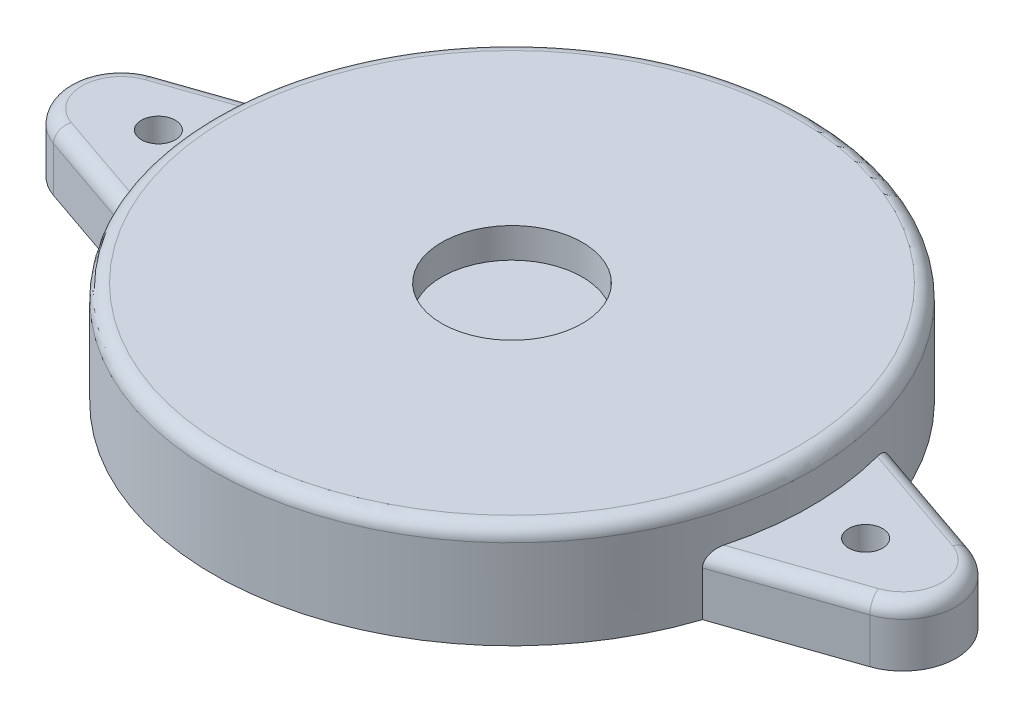
ISO-10303-21;
HEADER;
FILE_DESCRIPTION(('STEP AP214'),'2;1');
FILE_NAME('part.step','',(''),(''),'','','');
FILE_SCHEMA(('AUTOMOTIVE_DESIGN { 1 0 10303 214 1 1 1 1 }'));
ENDSEC;
DATA;
#1=APPLICATION_CONTEXT('core data for automotive mechanical design processes');
#2=APPLICATION_PROTOCOL_DEFINITION('international standard','automotive_design',2000,#1);
#3=PRODUCT_CONTEXT('',#1,'mechanical');
#4=PRODUCT('Part','Part','',(#3));
#5=PRODUCT_RELATED_PRODUCT_CATEGORY('part','',(#4));
#6=PRODUCT_DEFINITION_FORMATION('','',#4);
#7=PRODUCT_DEFINITION_CONTEXT('part definition',#1,'design');
#8=PRODUCT_DEFINITION('design','',#6,#7);
#9=PRODUCT_DEFINITION_SHAPE('','',#8);
#10=(LENGTH_UNIT() NAMED_UNIT(*) SI_UNIT(.MILLI.,.METRE.));
#11=(NAMED_UNIT(*) PLANE_ANGLE_UNIT() SI_UNIT($,.RADIAN.));
#12=(NAMED_UNIT(*) SI_UNIT($,.STERADIAN.) SOLID_ANGLE_UNIT());
#13=UNCERTAINTY_MEASURE_WITH_UNIT(LENGTH_MEASURE(1.E-05),#10,'distance_accuracy_value','');
#14=(GEOMETRIC_REPRESENTATION_CONTEXT(3) GLOBAL_UNCERTAINTY_ASSIGNED_CONTEXT((#13)) GLOBAL_UNIT_ASSIGNED_CONTEXT((#10,
#11,#12)) REPRESENTATION_CONTEXT('',''));
#15=CARTESIAN_POINT('',(0.,0.,0.));
#16=DIRECTION('',(0.,0.,1.));
#17=DIRECTION('',(1.,0.,0.));
#18=AXIS2_PLACEMENT_3D('',#15,#16,#17);
#19=CARTESIAN_POINT('',(0.,5.16,0.));
#20=DIRECTION('',(0.,-1.,0.));
#21=DIRECTION('',(0.,0.,-1.));
#22=AXIS2_PLACEMENT_3D('',#19,#20,#21);
#23=CYLINDRICAL_SURFACE('',#22,14.93);
#24=CARTESIAN_POINT('',(0.,4.46,0.));
#25=DIRECTION('',(0.,1.,0.));
#26=DIRECTION('',(0.,0.,1.));
#27=AXIS2_PLACEMENT_3D('',#24,#25,#26);
#28=CIRCLE('',#27,14.93);
#29=CARTESIAN_POINT('',(0.,4.46,14.93));
#30=VERTEX_POINT('',#29);
#31=EDGE_CURVE('E199',#30,#30,#28,.F.);
#32=ORIENTED_EDGE('',*,*,#31,.T.);
#33=EDGE_LOOP('',(#32));
#34=FACE_BOUND('',#33,.T.);
#35=CARTESIAN_POINT('',(0.,2.94,0.));
#36=DIRECTION('',(0.,-1.,0.));
#37=DIRECTION('',(0.,0.,-1.));
#38=AXIS2_PLACEMENT_3D('',#35,#36,#37);
#39=CIRCLE('',#38,14.93);
#40=CARTESIAN_POINT('',(-14.429087598297,2.94,3.8348834507287));
#41=VERTEX_POINT('',#40);
#42=CARTESIAN_POINT('',(-14.429087598297,2.94,-3.8348834507287));
#43=VERTEX_POINT('',#42);
#44=EDGE_CURVE('E160',#41,#43,#39,.T.);
#45=ORIENTED_EDGE('',*,*,#44,.F.);
#46=CARTESIAN_POINT('',(-14.429087598297,2.94,3.8348834507287));
#47=CARTESIAN_POINT('',(-14.4138774173166,2.93997814055828,3.8921743099573));
#48=CARTESIAN_POINT('',(-14.3982845537592,2.93480887956589,3.94941011262203));
#49=CARTESIAN_POINT('',(-14.3667965768096,2.91417210982097,4.06243771924972));
#50=CARTESIAN_POINT('',(-14.3509000239146,2.89861824672489,4.11821330467232));
#51=CARTESIAN_POINT('',(-14.3202531008862,2.85814754029159,4.22352402585155));
#52=CARTESIAN_POINT('',(-14.305483406981,2.83368591733759,4.2732273044714));
#53=CARTESIAN_POINT('',(-14.2771239902179,2.77541682636606,4.3670362653395));
#54=CARTESIAN_POINT('',(-14.2635295644546,2.74164911083228,4.41116461783673));
#55=CARTESIAN_POINT('',(-14.242478513252,2.67726120224456,4.47856390047529));
#56=CARTESIAN_POINT('',(-14.2344480605328,2.64907861241899,4.50399564814046));
#57=CARTESIAN_POINT('',(-14.219760478293,2.58871728969254,4.5501534800078));
#58=CARTESIAN_POINT('',(-14.2131033739341,2.5565384835928,4.57087947799488));
#59=CARTESIAN_POINT('',(-14.2015511147571,2.48845281904667,4.60664798740863));
#60=CARTESIAN_POINT('',(-14.1966728144079,2.45251425129202,4.6216361955794));
#61=CARTESIAN_POINT('',(-14.1892028208415,2.37825680983918,4.64452074193722));
#62=CARTESIAN_POINT('',(-14.1866043877521,2.33994531310194,4.65243798496127));
#63=CARTESIAN_POINT('',(-14.1849214181625,2.29108472920955,4.6575642029491));
#64=CARTESIAN_POINT('',(-14.1846584788022,2.28087987559489,4.6583649206828));
#65=CARTESIAN_POINT('',(-14.1843080413889,2.26045175313608,4.65943195312917));
#66=CARTESIAN_POINT('',(-14.184220329351,2.25022852203119,4.659698919651));
#67=CARTESIAN_POINT('',(-14.1842199529482,2.24,4.65970002536481));
#68=B_SPLINE_CURVE_WITH_KNOTS('',3,(#46,#47,#48,#49,#50,#51,#52,#53,#54,#55,#56,#57,#58,#59,#60,
#61,#62,#63,#64,#65,#66,#67),.UNSPECIFIED.,.F.,.F.,(4,2,2,2,2,2,2,2,2,2,4),(0.,
0.177689420451845,0.356875152519502,0.527957754312332,0.698320583460933,0.814287444919781,
0.930256430862166,1.04729732013803,1.16399102929701,1.19469972106421,1.22537088886555),.UNSPECIFIED.);
#69=CARTESIAN_POINT('',(-14.1842199529482,2.24,4.65970002536481));
#70=VERTEX_POINT('',#69);
#71=EDGE_CURVE('E43',#41,#70,#68,.T.);
#72=ORIENTED_EDGE('',*,*,#71,.T.);
#73=DIRECTION('',(0.,-1.,0.));
#74=VECTOR('',#73,1.);
#75=CARTESIAN_POINT('',(-14.1842199529482,2.94,4.65970002536481));
#76=LINE('',#75,#74);
#77=CARTESIAN_POINT('',(-14.1842199529482,0.,4.65970002536481));
#78=VERTEX_POINT('',#77);
#79=EDGE_CURVE('E135',#70,#78,#76,.T.);
#80=ORIENTED_EDGE('',*,*,#79,.T.);
#81=CARTESIAN_POINT('',(0.,0.,0.));
#82=DIRECTION('',(0.,1.,0.));
#83=DIRECTION('',(0.,0.,1.));
#84=AXIS2_PLACEMENT_3D('',#81,#82,#83);
#85=CIRCLE('',#84,14.93);
#86=CARTESIAN_POINT('',(14.1842199529483,0.,4.65970002536481));
#87=VERTEX_POINT('',#86);
#88=EDGE_CURVE('E147',#78,#87,#85,.T.);
#89=ORIENTED_EDGE('',*,*,#88,.T.);
#90=DIRECTION('',(0.,-1.,0.));
#91=VECTOR('',#90,1.);
#92=CARTESIAN_POINT('',(14.1842199529482,2.94,4.65970002536481));
#93=LINE('',#92,#91);
#94=CARTESIAN_POINT('',(14.1842199529482,2.24,4.65970002536481));
#95=VERTEX_POINT('',#94);
#96=EDGE_CURVE('E191',#95,#87,#93,.T.);
#97=ORIENTED_EDGE('',*,*,#96,.F.);
#98=CARTESIAN_POINT('',(14.1842199529482,2.24,4.65970002536481));
#99=CARTESIAN_POINT('',(14.1842190896717,2.25693649452195,4.65970201646287));
#100=CARTESIAN_POINT('',(14.184461026523,2.27386343904716,4.6589662491817));
#101=CARTESIAN_POINT('',(14.1854202016541,2.30756925031859,4.65604524308534));
#102=CARTESIAN_POINT('',(14.1861371831797,2.32434819209661,4.65386078726296));
#103=CARTESIAN_POINT('',(14.1889722437595,2.37406195090137,4.64521313316511));
#104=CARTESIAN_POINT('',(14.1917747600945,2.40661629321092,4.63665481022352));
#105=CARTESIAN_POINT('',(14.1989974675529,2.46965652039576,4.61448848816677));
#106=CARTESIAN_POINT('',(14.2034147720633,2.50014598190755,4.60088949919917));
#107=CARTESIAN_POINT('',(14.2135990146769,2.55856601677584,4.5693300993658));
#108=CARTESIAN_POINT('',(14.219367887,2.58649284229407,4.55136343655123));
#109=CARTESIAN_POINT('',(14.2324496611259,2.64139553893826,4.5102964837884));
#110=CARTESIAN_POINT('',(14.239847031579,2.66813434631393,4.48690821546017));
#111=CARTESIAN_POINT('',(14.255543759827,2.71792964715898,4.4367851705581));
#112=CARTESIAN_POINT('',(14.2638433119251,2.74098534474529,4.41004967290192));
#113=CARTESIAN_POINT('',(14.282757982286,2.78748441236427,4.34844257702542));
#114=CARTESIAN_POINT('',(14.2935083015561,2.81011977276594,4.3130029102126));
#115=CARTESIAN_POINT('',(14.3155306560991,2.84999580013863,4.23933536231764));
#116=CARTESIAN_POINT('',(14.326803306577,2.86722991003768,4.2011041611923));
#117=CARTESIAN_POINT('',(14.3516786781012,2.89899127627244,4.11540518367075));
#118=CARTESIAN_POINT('',(14.3653248558078,2.91241908179589,4.06754191138568));
#119=CARTESIAN_POINT('',(14.3924909249222,2.93160860206077,3.97034534492567));
#120=CARTESIAN_POINT('',(14.4060109908642,2.93738324223114,3.92101467352165));
#121=CARTESIAN_POINT('',(14.4225769534227,2.9397641173255,3.85931833082634));
#122=CARTESIAN_POINT('',(14.4258406872819,2.94000004110343,3.8471010798203));
#123=CARTESIAN_POINT('',(14.429087598297,2.94,3.8348834507287));
#124=B_SPLINE_CURVE_WITH_KNOTS('',3,(#98,#99,#100,#101,#102,#103,#104,#105,#106,#107,#108,#109,
#110,#111,#112,#113,#114,#115,#116,#117,#118,#119,#120,#121,#122,#123),.UNSPECIFIED.,.F.,.F.,(4,
2,2,2,2,2,2,2,2,2,2,2,4),(0.,0.0507734722109093,0.101519524519104,0.202294433131119,
0.302890069371643,0.403630556349275,0.512094664936698,0.620582179917424,0.750311736923561,
0.880198179861179,1.03423986539473,1.18802105701897,1.22595505623296),.UNSPECIFIED.);
#125=CARTESIAN_POINT('',(14.429087598297,2.94,3.8348834507287));
#126=VERTEX_POINT('',#125);
#127=EDGE_CURVE('E11',#95,#126,#124,.T.);
#128=ORIENTED_EDGE('',*,*,#127,.T.);
#129=CARTESIAN_POINT('',(0.,2.94,0.));
#130=DIRECTION('',(0.,-1.,0.));
#131=DIRECTION('',(0.,0.,1.));
#132=AXIS2_PLACEMENT_3D('',#129,#130,#131);
#133=CIRCLE('',#132,14.93);
#134=CARTESIAN_POINT('',(14.429087598297,2.94,-3.8348834507287));
#135=VERTEX_POINT('',#134);
#136=EDGE_CURVE('E174',#135,#126,#133,.T.);
#137=ORIENTED_EDGE('',*,*,#136,.F.);
#138=CARTESIAN_POINT('',(14.429087598297,2.94,-3.8348834507287));
#139=CARTESIAN_POINT('',(14.4138774173166,2.93997814055828,-3.8921743099573));
#140=CARTESIAN_POINT('',(14.3982845537592,2.93480887956589,-3.94941011262203));
#141=CARTESIAN_POINT('',(14.3667965768096,2.91417210982097,-4.06243771924972));
#142=CARTESIAN_POINT('',(14.3509000239146,2.89861824672489,-4.11821330467232));
#143=CARTESIAN_POINT('',(14.3202531008862,2.85814754029159,-4.22352402585155));
#144=CARTESIAN_POINT('',(14.305483406981,2.83368591733758,-4.2732273044714));
#145=CARTESIAN_POINT('',(14.2771239902179,2.77541682636606,-4.3670362653395));
#146=CARTESIAN_POINT('',(14.2635295644546,2.74164911083227,-4.41116461783674));
#147=CARTESIAN_POINT('',(14.242478513252,2.67726120224456,-4.47856390047529));
#148=CARTESIAN_POINT('',(14.2344480605328,2.64907861241899,-4.50399564814046));
#149=CARTESIAN_POINT('',(14.219760478293,2.58871728969254,-4.5501534800078));
#150=CARTESIAN_POINT('',(14.2131033739341,2.5565384835928,-4.57087947799488));
#151=CARTESIAN_POINT('',(14.2015511147571,2.48845281904666,-4.60664798740864));
#152=CARTESIAN_POINT('',(14.1966728144079,2.45251425129201,-4.6216361955794));
#153=CARTESIAN_POINT('',(14.1892028208415,2.37825680983918,-4.64452074193722));
#154=CARTESIAN_POINT('',(14.1866043877521,2.33994531310193,-4.65243798496127));
#155=CARTESIAN_POINT('',(14.1849214181625,2.29108472920955,-4.6575642029491));
#156=CARTESIAN_POINT('',(14.1846584788022,2.28087987559489,-4.6583649206828));
#157=CARTESIAN_POINT('',(14.1843080413889,2.26045175313608,-4.65943195312917));
#158=CARTESIAN_POINT('',(14.184220329351,2.25022852203119,-4.659698919651));
#159=CARTESIAN_POINT('',(14.1842199529482,2.24,-4.65970002536481));
#160=B_SPLINE_CURVE_WITH_KNOTS('',3,(#138,#139,#140,#141,#142,#143,#144,#145,#146,#147,#148,
#149,#150,#151,#152,#153,#154,#155,#156,#157,#158,#159),.UNSPECIFIED.,.F.,.F.,(4,2,2,2,2,2,2,2,
2,2,4),(0.,0.177689420451847,0.356875152519503,0.527957754312334,0.698320583460934,
0.814287444919785,0.930256430862171,1.04729732013804,1.16399102929701,1.19469972106422,
1.22537088886555),.UNSPECIFIED.);
#161=CARTESIAN_POINT('',(14.1842199529482,2.24,-4.65970002536481));
#162=VERTEX_POINT('',#161);
#163=EDGE_CURVE('E233',#135,#162,#160,.T.);
#164=ORIENTED_EDGE('',*,*,#163,.T.);
#165=DIRECTION('',(0.,-1.,0.));
#166=VECTOR('',#165,1.);
#167=CARTESIAN_POINT('',(14.1842199529482,2.94,-4.65970002536481));
#168=LINE('',#167,#166);
#169=CARTESIAN_POINT('',(14.1842199529482,0.,-4.65970002536481));
#170=VERTEX_POINT('',#169);
#171=EDGE_CURVE('E177',#162,#170,#168,.T.);
#172=ORIENTED_EDGE('',*,*,#171,.T.);
#173=CARTESIAN_POINT('',(-14.1842199529483,0.,-4.65970002536481));
#174=VERTEX_POINT('',#173);
#175=EDGE_CURVE('E193',#170,#174,#85,.T.);
#176=ORIENTED_EDGE('',*,*,#175,.T.);
#177=DIRECTION('',(0.,-1.,0.));
#178=VECTOR('',#177,1.);
#179=CARTESIAN_POINT('',(-14.1842199529482,2.94,-4.65970002536481));
#180=LINE('',#179,#178);
#181=CARTESIAN_POINT('',(-14.1842199529482,2.24,-4.65970002536481));
#182=VERTEX_POINT('',#181);
#183=EDGE_CURVE('E165',#182,#174,#180,.T.);
#184=ORIENTED_EDGE('',*,*,#183,.F.);
#185=CARTESIAN_POINT('',(-14.1842199529482,2.24,-4.65970002536481));
#186=CARTESIAN_POINT('',(-14.1842190896717,2.25693649452195,-4.65970201646287));
#187=CARTESIAN_POINT('',(-14.184461026523,2.27386343904716,-4.6589662491817));
#188=CARTESIAN_POINT('',(-14.1854202016541,2.30756925031859,-4.65604524308534));
#189=CARTESIAN_POINT('',(-14.1861371831797,2.32434819209661,-4.65386078726296));
#190=CARTESIAN_POINT('',(-14.1889722437595,2.37406195090137,-4.64521313316511));
#191=CARTESIAN_POINT('',(-14.1917747600945,2.40661629321092,-4.63665481022352));
#192=CARTESIAN_POINT('',(-14.1989974675529,2.46965652039576,-4.61448848816677));
#193=CARTESIAN_POINT('',(-14.2034147720633,2.50014598190755,-4.60088949919916));
#194=CARTESIAN_POINT('',(-14.2135990146769,2.55856601677584,-4.5693300993658));
#195=CARTESIAN_POINT('',(-14.219367887,2.58649284229407,-4.55136343655123));
#196=CARTESIAN_POINT('',(-14.2324496611259,2.64139553893826,-4.5102964837884));
#197=CARTESIAN_POINT('',(-14.239847031579,2.66813434631393,-4.48690821546017));
#198=CARTESIAN_POINT('',(-14.255543759827,2.71792964715898,-4.4367851705581));
#199=CARTESIAN_POINT('',(-14.2638433119251,2.74098534474529,-4.41004967290191));
#200=CARTESIAN_POINT('',(-14.282757982286,2.78748441236427,-4.34844257702541));
#201=CARTESIAN_POINT('',(-14.2935083015561,2.81011977276594,-4.3130029102126));
#202=CARTESIAN_POINT('',(-14.3155306560991,2.84999580013863,-4.23933536231764));
#203=CARTESIAN_POINT('',(-14.326803306577,2.86722991003768,-4.2011041611923));
#204=CARTESIAN_POINT('',(-14.3516786781012,2.89899127627244,-4.11540518367075));
#205=CARTESIAN_POINT('',(-14.3653248558078,2.91241908179589,-4.06754191138568));
#206=CARTESIAN_POINT('',(-14.3924909249222,2.93160860206077,-3.97034534492567));
#207=CARTESIAN_POINT('',(-14.4060109908642,2.93738324223114,-3.92101467352165));
#208=CARTESIAN_POINT('',(-14.4225769534227,2.9397641173255,-3.85931833082634));
#209=CARTESIAN_POINT('',(-14.4258406872819,2.94000004110343,-3.8471010798203));
#210=CARTESIAN_POINT('',(-14.429087598297,2.94,-3.8348834507287));
#211=B_SPLINE_CURVE_WITH_KNOTS('',3,(#185,#186,#187,#188,#189,#190,#191,#192,#193,#194,#195,
#196,#197,#198,#199,#200,#201,#202,#203,#204,#205,#206,#207,#208,#209,#210),.UNSPECIFIED.,.F.,
.F.,(4,2,2,2,2,2,2,2,2,2,2,2,4),(0.,0.0507734722109094,0.101519524519103,0.202294433131119,
0.302890069371642,0.403630556349275,0.512094664936698,0.620582179917423,0.75031173692356,
0.880198179861176,1.03423986539473,1.18802105701897,1.22595505623296),.UNSPECIFIED.);
#212=EDGE_CURVE('E226',#182,#43,#211,.T.);
#213=ORIENTED_EDGE('',*,*,#212,.T.);
#214=EDGE_LOOP('',(#45,#72,#80,#89,#97,#128,#137,#164,#172,#176,#184,#213));
#215=FACE_BOUND('',#214,.T.);
#216=ADVANCED_FACE('F33',(#34,#215),#23,.T.);
#217=CARTESIAN_POINT('',(0.,5.16,0.));
#218=DIRECTION('',(0.,1.,0.));
#219=DIRECTION('',(0.,0.,1.));
#220=AXIS2_PLACEMENT_3D('',#217,#218,#219);
#221=PLANE('',#220);
#222=CARTESIAN_POINT('',(0.,5.16,0.));
#223=DIRECTION('',(0.,1.,0.));
#224=DIRECTION('',(0.,0.,1.));
#225=AXIS2_PLACEMENT_3D('',#222,#223,#224);
#226=CIRCLE('',#225,3.515);
#227=CARTESIAN_POINT('',(0.,5.16,3.515));
#228=VERTEX_POINT('',#227);
#229=EDGE_CURVE('E278',#228,#228,#226,.T.);
#230=ORIENTED_EDGE('',*,*,#229,.F.);
#231=EDGE_LOOP('',(#230));
#232=FACE_BOUND('',#231,.T.);
#233=CARTESIAN_POINT('',(0.,5.16,0.));
#234=DIRECTION('',(0.,1.,0.));
#235=DIRECTION('',(0.,0.,1.));
#236=AXIS2_PLACEMENT_3D('',#233,#234,#235);
#237=CIRCLE('',#236,14.23);
#238=CARTESIAN_POINT('',(0.,5.16,14.23));
#239=VERTEX_POINT('',#238);
#240=EDGE_CURVE('E196',#239,#239,#237,.T.);
#241=ORIENTED_EDGE('',*,*,#240,.T.);
#242=EDGE_LOOP('',(#241));
#243=FACE_BOUND('',#242,.T.);
#244=ADVANCED_FACE('F303',(#232,#243),#221,.T.);
#245=CARTESIAN_POINT('',(0.,0.,0.));
#246=DIRECTION('',(0.,1.,0.));
#247=DIRECTION('',(0.,0.,1.));
#248=AXIS2_PLACEMENT_3D('',#245,#246,#247);
#249=PLANE('',#248);
#250=ORIENTED_EDGE('',*,*,#175,.F.);
#251=DIRECTION('',(-0.945415498264678,0.,-0.325867358968263));
#252=VECTOR('',#251,1.);
#253=CARTESIAN_POINT('',(14.1842199529482,0.,-4.65970002536481));
#254=LINE('',#253,#252);
#255=CARTESIAN_POINT('',(20.4067284526636,0.,-2.51491562667268));
#256=VERTEX_POINT('',#255);
#257=EDGE_CURVE('E178',#256,#170,#254,.T.);
#258=ORIENTED_EDGE('',*,*,#257,.F.);
#259=CARTESIAN_POINT('',(19.5398832245115,0.,0.));
#260=DIRECTION('',(0.,1.,0.));
#261=DIRECTION('',(0.,0.,1.));
#262=AXIS2_PLACEMENT_3D('',#259,#260,#261);
#263=CIRCLE('',#262,2.66011677541656);
#264=CARTESIAN_POINT('',(20.4067284526636,0.,2.51491562667268));
#265=VERTEX_POINT('',#264);
#266=EDGE_CURVE('E181',#265,#256,#263,.T.);
#267=ORIENTED_EDGE('',*,*,#266,.F.);
#268=DIRECTION('',(0.945415498264678,0.,-0.325867358968263));
#269=VECTOR('',#268,1.);
#270=CARTESIAN_POINT('',(14.1842199529482,0.,4.65970002536481));
#271=LINE('',#270,#269);
#272=EDGE_CURVE('E171',#87,#265,#271,.T.);
#273=ORIENTED_EDGE('',*,*,#272,.F.);
#274=ORIENTED_EDGE('',*,*,#88,.F.);
#275=DIRECTION('',(0.945415498264678,0.,0.325867358968263));
#276=VECTOR('',#275,1.);
#277=CARTESIAN_POINT('',(-14.1842199529482,0.,4.65970002536481));
#278=LINE('',#277,#276);
#279=CARTESIAN_POINT('',(-20.4067284526636,0.,2.51491562667268));
#280=VERTEX_POINT('',#279);
#281=EDGE_CURVE('E128',#280,#78,#278,.T.);
#282=ORIENTED_EDGE('',*,*,#281,.F.);
#283=CARTESIAN_POINT('',(-19.5398832245115,0.,0.));
#284=DIRECTION('',(0.,1.,0.));
#285=DIRECTION('',(0.,0.,-1.));
#286=AXIS2_PLACEMENT_3D('',#283,#284,#285);
#287=CIRCLE('',#286,2.66011677541656);
#288=CARTESIAN_POINT('',(-20.4067284526636,0.,-2.51491562667268));
#289=VERTEX_POINT('',#288);
#290=EDGE_CURVE('E144',#289,#280,#287,.T.);
#291=ORIENTED_EDGE('',*,*,#290,.F.);
#292=DIRECTION('',(-0.945415498264678,0.,0.325867358968263));
#293=VECTOR('',#292,1.);
#294=CARTESIAN_POINT('',(-14.1842199529482,0.,-4.65970002536481));
#295=LINE('',#294,#293);
#296=EDGE_CURVE('E148',#174,#289,#295,.T.);
#297=ORIENTED_EDGE('',*,*,#296,.F.);
#298=EDGE_LOOP('',(#250,#258,#267,#273,#274,#282,#291,#297));
#299=FACE_BOUND('',#298,.T.);
#300=CARTESIAN_POINT('',(17.679999999928,0.,0.));
#301=DIRECTION('',(0.,1.,0.));
#302=DIRECTION('',(0.,0.,1.));
#303=AXIS2_PLACEMENT_3D('',#300,#301,#302);
#304=CIRCLE('',#303,0.85);
#305=CARTESIAN_POINT('',(17.679999999928,0.,0.85));
#306=VERTEX_POINT('',#305);
#307=EDGE_CURVE('E134',#306,#306,#304,.T.);
#308=ORIENTED_EDGE('',*,*,#307,.T.);
#309=EDGE_LOOP('',(#308));
#310=FACE_BOUND('',#309,.T.);
#311=CARTESIAN_POINT('',(-17.679999999928,0.,0.));
#312=DIRECTION('',(0.,1.,0.));
#313=DIRECTION('',(0.,0.,-1.));
#314=AXIS2_PLACEMENT_3D('',#311,#312,#313);
#315=CIRCLE('',#314,0.85);
#316=CARTESIAN_POINT('',(-17.679999999928,0.,-0.849999999999999));
#317=VERTEX_POINT('',#316);
#318=EDGE_CURVE('E157',#317,#317,#315,.T.);
#319=ORIENTED_EDGE('',*,*,#318,.T.);
#320=EDGE_LOOP('',(#319));
#321=FACE_BOUND('',#320,.T.);
#322=ADVANCED_FACE('F141',(#299,#310,#321),#249,.F.);
#323=CARTESIAN_POINT('',(0.,2.94,0.));
#324=DIRECTION('',(0.,1.,0.));
#325=DIRECTION('',(0.,0.,1.));
#326=AXIS2_PLACEMENT_3D('',#323,#324,#325);
#327=PLANE('',#326);
#328=CARTESIAN_POINT('',(19.5398832245115,2.94,0.));
#329=DIRECTION('',(0.,1.,0.));
#330=DIRECTION('',(0.,0.,1.));
#331=AXIS2_PLACEMENT_3D('',#328,#329,#330);
#332=CIRCLE('',#331,1.96011677541656);
#333=CARTESIAN_POINT('',(20.1786213013859,2.94,1.8531247778874));
#334=VERTEX_POINT('',#333);
#335=CARTESIAN_POINT('',(20.1786213013859,2.94,-1.8531247778874));
#336=VERTEX_POINT('',#335);
#337=EDGE_CURVE('E215',#334,#336,#332,.T.);
#338=ORIENTED_EDGE('',*,*,#337,.T.);
#339=DIRECTION('',(-0.945415498264678,0.,-0.325867358968263));
#340=VECTOR('',#339,1.);
#341=CARTESIAN_POINT('',(13.9561128016705,2.94,-3.99790917657953));
#342=LINE('',#341,#340);
#343=EDGE_CURVE('E217',#336,#135,#342,.T.);
#344=ORIENTED_EDGE('',*,*,#343,.T.);
#345=ORIENTED_EDGE('',*,*,#136,.T.);
#346=DIRECTION('',(0.945415498264678,0.,-0.325867358968263));
#347=VECTOR('',#346,1.);
#348=CARTESIAN_POINT('',(20.1786213013859,2.94,1.8531247778874));
#349=LINE('',#348,#347);
#350=EDGE_CURVE('E213',#126,#334,#349,.T.);
#351=ORIENTED_EDGE('',*,*,#350,.T.);
#352=EDGE_LOOP('',(#338,#344,#345,#351));
#353=FACE_BOUND('',#352,.T.);
#354=CARTESIAN_POINT('',(17.679999999928,2.94,0.));
#355=DIRECTION('',(0.,1.,0.));
#356=DIRECTION('',(0.,0.,1.));
#357=AXIS2_PLACEMENT_3D('',#354,#355,#356);
#358=CIRCLE('',#357,0.85);
#359=CARTESIAN_POINT('',(17.679999999928,2.94,0.85));
#360=VERTEX_POINT('',#359);
#361=EDGE_CURVE('E168',#360,#360,#358,.T.);
#362=ORIENTED_EDGE('',*,*,#361,.F.);
#363=EDGE_LOOP('',(#362));
#364=FACE_BOUND('',#363,.T.);
#365=ADVANCED_FACE('F337',(#353,#364),#327,.T.);
#366=CARTESIAN_POINT('',(14.1842199529482,2.94,4.65970002536481));
#367=DIRECTION('',(-0.325867358968263,0.,-0.945415498264678));
#368=DIRECTION('',(-0.945415498264678,0.,0.325867358968263));
#369=AXIS2_PLACEMENT_3D('',#366,#367,#368);
#370=PLANE('',#369);
#371=DIRECTION('',(0.,-1.,0.));
#372=VECTOR('',#371,1.);
#373=CARTESIAN_POINT('',(20.4067284526636,2.94,2.51491562667268));
#374=LINE('',#373,#372);
#375=CARTESIAN_POINT('',(20.4067284526636,2.24,2.51491562667268));
#376=VERTEX_POINT('',#375);
#377=EDGE_CURVE('E189',#376,#265,#374,.T.);
#378=ORIENTED_EDGE('',*,*,#377,.F.);
#379=DIRECTION('',(0.945415498264678,0.,-0.325867358968263));
#380=VECTOR('',#379,1.);
#381=CARTESIAN_POINT('',(14.1842199529482,2.24,4.65970002536481));
#382=LINE('',#381,#380);
#383=EDGE_CURVE('E51',#376,#95,#382,.F.);
#384=ORIENTED_EDGE('',*,*,#383,.T.);
#385=ORIENTED_EDGE('',*,*,#96,.T.);
#386=ORIENTED_EDGE('',*,*,#272,.T.);
#387=EDGE_LOOP('',(#378,#384,#385,#386));
#388=FACE_BOUND('',#387,.T.);
#389=ADVANCED_FACE('F340',(#388),#370,.F.);
#390=CARTESIAN_POINT('',(19.5398832245115,2.94,0.));
#391=DIRECTION('',(0.,-1.,0.));
#392=DIRECTION('',(0.,0.,-1.));
#393=AXIS2_PLACEMENT_3D('',#390,#391,#392);
#394=CYLINDRICAL_SURFACE('',#393,2.66011677541656);
#395=DIRECTION('',(0.,-1.,0.));
#396=VECTOR('',#395,1.);
#397=CARTESIAN_POINT('',(20.4067284526636,2.94,-2.51491562667268));
#398=LINE('',#397,#396);
#399=CARTESIAN_POINT('',(20.4067284526636,2.24,-2.51491562667268));
#400=VERTEX_POINT('',#399);
#401=EDGE_CURVE('E187',#400,#256,#398,.T.);
#402=ORIENTED_EDGE('',*,*,#401,.F.);
#403=CARTESIAN_POINT('',(19.5398832245115,2.24,0.));
#404=DIRECTION('',(0.,1.,0.));
#405=DIRECTION('',(0.,0.,1.));
#406=AXIS2_PLACEMENT_3D('',#403,#404,#405);
#407=CIRCLE('',#406,2.66011677541656);
#408=EDGE_CURVE('E222',#400,#376,#407,.F.);
#409=ORIENTED_EDGE('',*,*,#408,.T.);
#410=ORIENTED_EDGE('',*,*,#377,.T.);
#411=ORIENTED_EDGE('',*,*,#266,.T.);
#412=EDGE_LOOP('',(#402,#409,#410,#411));
#413=FACE_BOUND('',#412,.T.);
#414=ADVANCED_FACE('F344',(#413),#394,.T.);
#415=CARTESIAN_POINT('',(14.1842199529482,2.94,-4.65970002536481));
#416=DIRECTION('',(-0.325867358968263,0.,0.945415498264678));
#417=DIRECTION('',(0.945415498264678,0.,0.325867358968263));
#418=AXIS2_PLACEMENT_3D('',#415,#416,#417);
#419=PLANE('',#418);
#420=ORIENTED_EDGE('',*,*,#171,.F.);
#421=DIRECTION('',(-0.945415498264678,0.,-0.325867358968263));
#422=VECTOR('',#421,1.);
#423=CARTESIAN_POINT('',(20.4067284526636,2.24,-2.51491562667268));
#424=LINE('',#423,#422);
#425=EDGE_CURVE('E220',#162,#400,#424,.F.);
#426=ORIENTED_EDGE('',*,*,#425,.T.);
#427=ORIENTED_EDGE('',*,*,#401,.T.);
#428=ORIENTED_EDGE('',*,*,#257,.T.);
#429=EDGE_LOOP('',(#420,#426,#427,#428));
#430=FACE_BOUND('',#429,.T.);
#431=ADVANCED_FACE('F331',(#430),#419,.F.);
#432=CARTESIAN_POINT('',(17.679999999928,2.94,0.));
#433=DIRECTION('',(0.,-1.,0.));
#434=DIRECTION('',(0.,0.,-1.));
#435=AXIS2_PLACEMENT_3D('',#432,#433,#434);
#436=CYLINDRICAL_SURFACE('',#435,0.85);
#437=ORIENTED_EDGE('',*,*,#361,.T.);
#438=EDGE_LOOP('',(#437));
#439=FACE_BOUND('',#438,.T.);
#440=ORIENTED_EDGE('',*,*,#307,.F.);
#441=EDGE_LOOP('',(#440));
#442=FACE_BOUND('',#441,.T.);
#443=ADVANCED_FACE('F324',(#439,#442),#436,.F.);
#444=CARTESIAN_POINT('',(-19.5398832245115,2.94,0.));
#445=DIRECTION('',(0.,-1.,0.));
#446=DIRECTION('',(0.,0.,-1.));
#447=AXIS2_PLACEMENT_3D('',#444,#445,#446);
#448=PLANE('',#447);
#449=ORIENTED_EDGE('',*,*,#44,.T.);
#450=DIRECTION('',(-0.945415498264678,0.,0.325867358968263));
#451=VECTOR('',#450,1.);
#452=CARTESIAN_POINT('',(-20.1786213013859,2.94,-1.8531247778874));
#453=LINE('',#452,#451);
#454=CARTESIAN_POINT('',(-20.1786213013859,2.94,-1.8531247778874));
#455=VERTEX_POINT('',#454);
#456=EDGE_CURVE('E206',#43,#455,#453,.T.);
#457=ORIENTED_EDGE('',*,*,#456,.T.);
#458=CARTESIAN_POINT('',(-19.5398832245115,2.94,0.));
#459=DIRECTION('',(0.,-1.,0.));
#460=DIRECTION('',(0.,0.,-1.));
#461=AXIS2_PLACEMENT_3D('',#458,#459,#460);
#462=CIRCLE('',#461,1.96011677541656);
#463=CARTESIAN_POINT('',(-20.1786213013859,2.94,1.8531247778874));
#464=VERTEX_POINT('',#463);
#465=EDGE_CURVE('E204',#455,#464,#462,.F.);
#466=ORIENTED_EDGE('',*,*,#465,.T.);
#467=DIRECTION('',(0.945415498264678,0.,0.325867358968263));
#468=VECTOR('',#467,1.);
#469=CARTESIAN_POINT('',(-20.1786213013859,2.94,1.8531247778874));
#470=LINE('',#469,#468);
#471=EDGE_CURVE('E202',#464,#41,#470,.T.);
#472=ORIENTED_EDGE('',*,*,#471,.T.);
#473=EDGE_LOOP('',(#449,#457,#466,#472));
#474=FACE_BOUND('',#473,.T.);
#475=CARTESIAN_POINT('',(-17.679999999928,2.94,0.));
#476=DIRECTION('',(0.,1.,0.));
#477=DIRECTION('',(0.,0.,-1.));
#478=AXIS2_PLACEMENT_3D('',#475,#476,#477);
#479=CIRCLE('',#478,0.85);
#480=CARTESIAN_POINT('',(-17.679999999928,2.94,-0.849999999999999));
#481=VERTEX_POINT('',#480);
#482=EDGE_CURVE('E154',#481,#481,#479,.T.);
#483=ORIENTED_EDGE('',*,*,#482,.F.);
#484=EDGE_LOOP('',(#483));
#485=FACE_BOUND('',#484,.T.);
#486=ADVANCED_FACE('F321',(#474,#485),#448,.F.);
#487=CARTESIAN_POINT('',(-19.5398832245115,2.94,0.));
#488=DIRECTION('',(0.,-1.,0.));
#489=DIRECTION('',(0.,0.,-1.));
#490=AXIS2_PLACEMENT_3D('',#487,#488,#489);
#491=CYLINDRICAL_SURFACE('',#490,2.66011677541656);
#492=DIRECTION('',(0.,-1.,0.));
#493=VECTOR('',#492,1.);
#494=CARTESIAN_POINT('',(-20.4067284526636,2.94,2.51491562667268));
#495=LINE('',#494,#493);
#496=CARTESIAN_POINT('',(-20.4067284526636,2.24,2.51491562667268));
#497=VERTEX_POINT('',#496);
#498=EDGE_CURVE('E125',#497,#280,#495,.T.);
#499=ORIENTED_EDGE('',*,*,#498,.F.);
#500=CARTESIAN_POINT('',(-19.5398832245115,2.24,0.));
#501=DIRECTION('',(0.,-1.,0.));
#502=DIRECTION('',(0.,0.,-1.));
#503=AXIS2_PLACEMENT_3D('',#500,#501,#502);
#504=CIRCLE('',#503,2.66011677541656);
#505=CARTESIAN_POINT('',(-20.4067284526636,2.24,-2.51491562667268));
#506=VERTEX_POINT('',#505);
#507=EDGE_CURVE('E211',#497,#506,#504,.T.);
#508=ORIENTED_EDGE('',*,*,#507,.T.);
#509=DIRECTION('',(0.,-1.,0.));
#510=VECTOR('',#509,1.);
#511=CARTESIAN_POINT('',(-20.4067284526636,2.94,-2.51491562667268));
#512=LINE('',#511,#510);
#513=EDGE_CURVE('E152',#506,#289,#512,.T.);
#514=ORIENTED_EDGE('',*,*,#513,.T.);
#515=ORIENTED_EDGE('',*,*,#290,.T.);
#516=EDGE_LOOP('',(#499,#508,#514,#515));
#517=FACE_BOUND('',#516,.T.);
#518=ADVANCED_FACE('F150',(#517),#491,.T.);
#519=CARTESIAN_POINT('',(-14.1842199529482,2.94,4.65970002536481));
#520=DIRECTION('',(0.325867358968263,0.,-0.945415498264678));
#521=DIRECTION('',(-0.945415498264678,0.,-0.325867358968263));
#522=AXIS2_PLACEMENT_3D('',#519,#520,#521);
#523=PLANE('',#522);
#524=ORIENTED_EDGE('',*,*,#79,.F.);
#525=DIRECTION('',(0.945415498264678,0.,0.325867358968263));
#526=VECTOR('',#525,1.);
#527=CARTESIAN_POINT('',(-14.1842199529482,2.24,4.65970002536481));
#528=LINE('',#527,#526);
#529=EDGE_CURVE('E130',#70,#497,#528,.F.);
#530=ORIENTED_EDGE('',*,*,#529,.T.);
#531=ORIENTED_EDGE('',*,*,#498,.T.);
#532=ORIENTED_EDGE('',*,*,#281,.T.);
#533=EDGE_LOOP('',(#524,#530,#531,#532));
#534=FACE_BOUND('',#533,.T.);
#535=ADVANCED_FACE('F127',(#534),#523,.F.);
#536=CARTESIAN_POINT('',(-14.1842199529482,2.94,-4.65970002536481));
#537=DIRECTION('',(0.325867358968263,0.,0.945415498264678));
#538=DIRECTION('',(0.945415498264678,0.,-0.325867358968263));
#539=AXIS2_PLACEMENT_3D('',#536,#537,#538);
#540=PLANE('',#539);
#541=ORIENTED_EDGE('',*,*,#513,.F.);
#542=DIRECTION('',(-0.945415498264678,0.,0.325867358968263));
#543=VECTOR('',#542,1.);
#544=CARTESIAN_POINT('',(-14.1842199529482,2.24,-4.65970002536481));
#545=LINE('',#544,#543);
#546=EDGE_CURVE('E209',#506,#182,#545,.F.);
#547=ORIENTED_EDGE('',*,*,#546,.T.);
#548=ORIENTED_EDGE('',*,*,#183,.T.);
#549=ORIENTED_EDGE('',*,*,#296,.T.);
#550=EDGE_LOOP('',(#541,#547,#548,#549));
#551=FACE_BOUND('',#550,.T.);
#552=ADVANCED_FACE('F290',(#551),#540,.F.);
#553=CARTESIAN_POINT('',(-17.679999999928,2.94,0.));
#554=DIRECTION('',(0.,-1.,0.));
#555=DIRECTION('',(0.,0.,-1.));
#556=AXIS2_PLACEMENT_3D('',#553,#554,#555);
#557=CYLINDRICAL_SURFACE('',#556,0.85);
#558=ORIENTED_EDGE('',*,*,#482,.T.);
#559=EDGE_LOOP('',(#558));
#560=FACE_BOUND('',#559,.T.);
#561=ORIENTED_EDGE('',*,*,#318,.F.);
#562=EDGE_LOOP('',(#561));
#563=FACE_BOUND('',#562,.T.);
#564=ADVANCED_FACE('F288',(#560,#563),#557,.F.);
#565=CARTESIAN_POINT('',(0.,4.46,0.));
#566=DIRECTION('',(0.,1.,0.));
#567=DIRECTION('',(0.,0.,1.));
#568=AXIS2_PLACEMENT_3D('',#565,#566,#567);
#569=TOROIDAL_SURFACE('',#568,14.23,0.7);
#570=ORIENTED_EDGE('',*,*,#31,.F.);
#571=EDGE_LOOP('',(#570));
#572=FACE_BOUND('',#571,.T.);
#573=ORIENTED_EDGE('',*,*,#240,.F.);
#574=EDGE_LOOP('',(#573));
#575=FACE_BOUND('',#574,.T.);
#576=ADVANCED_FACE('F248',(#572,#575),#569,.T.);
#577=CARTESIAN_POINT('',(-20.1786213013859,2.24,1.8531247778874));
#578=DIRECTION('',(0.945415498264678,0.,0.325867358968263));
#579=DIRECTION('',(0.325867358968263,0.,-0.945415498264678));
#580=AXIS2_PLACEMENT_3D('',#577,#578,#579);
#581=CYLINDRICAL_SURFACE('',#580,0.7);
#582=ORIENTED_EDGE('',*,*,#71,.F.);
#583=ORIENTED_EDGE('',*,*,#471,.F.);
#584=CARTESIAN_POINT('',(-20.1786213013859,2.24,1.8531247778874));
#585=DIRECTION('',(-0.945415498264678,0.,-0.325867358968262));
#586=DIRECTION('',(-0.325867358968262,0.,0.945415498264678));
#587=AXIS2_PLACEMENT_3D('',#584,#585,#586);
#588=CIRCLE('',#587,0.7);
#589=EDGE_CURVE('E267',#497,#464,#588,.T.);
#590=ORIENTED_EDGE('',*,*,#589,.F.);
#591=ORIENTED_EDGE('',*,*,#529,.F.);
#592=EDGE_LOOP('',(#582,#583,#590,#591));
#593=FACE_BOUND('',#592,.T.);
#594=ADVANCED_FACE('F251',(#593),#581,.T.);
#595=CARTESIAN_POINT('',(-19.5398832245115,2.24,0.));
#596=DIRECTION('',(0.,-1.,0.));
#597=DIRECTION('',(0.,0.,-1.));
#598=AXIS2_PLACEMENT_3D('',#595,#596,#597);
#599=TOROIDAL_SURFACE('',#598,1.96011677541656,0.7);
#600=ORIENTED_EDGE('',*,*,#589,.T.);
#601=ORIENTED_EDGE('',*,*,#465,.F.);
#602=CARTESIAN_POINT('',(-20.1786213013859,2.24,-1.8531247778874));
#603=DIRECTION('',(0.945415498264678,0.,-0.325867358968262));
#604=DIRECTION('',(-0.325867358968262,0.,-0.945415498264678));
#605=AXIS2_PLACEMENT_3D('',#602,#603,#604);
#606=CIRCLE('',#605,0.7);
#607=EDGE_CURVE('E265',#506,#455,#606,.T.);
#608=ORIENTED_EDGE('',*,*,#607,.F.);
#609=ORIENTED_EDGE('',*,*,#507,.F.);
#610=EDGE_LOOP('',(#600,#601,#608,#609));
#611=FACE_BOUND('',#610,.T.);
#612=ADVANCED_FACE('F246',(#611),#599,.T.);
#613=CARTESIAN_POINT('',(-20.1786213013859,2.24,-1.8531247778874));
#614=DIRECTION('',(-0.945415498264678,0.,0.325867358968263));
#615=DIRECTION('',(0.325867358968263,0.,0.945415498264678));
#616=AXIS2_PLACEMENT_3D('',#613,#614,#615);
#617=CYLINDRICAL_SURFACE('',#616,0.7);
#618=ORIENTED_EDGE('',*,*,#212,.F.);
#619=ORIENTED_EDGE('',*,*,#546,.F.);
#620=ORIENTED_EDGE('',*,*,#607,.T.);
#621=ORIENTED_EDGE('',*,*,#456,.F.);
#622=EDGE_LOOP('',(#618,#619,#620,#621));
#623=FACE_BOUND('',#622,.T.);
#624=ADVANCED_FACE('F242',(#623),#617,.T.);
#625=CARTESIAN_POINT('',(2.71366920296367,2.24,7.87297300892069));
#626=DIRECTION('',(-0.945415498264678,0.,0.325867358968263));
#627=DIRECTION('',(0.325867358968263,0.,0.945415498264678));
#628=AXIS2_PLACEMENT_3D('',#625,#626,#627);
#629=CYLINDRICAL_SURFACE('',#628,0.7);
#630=ORIENTED_EDGE('',*,*,#127,.F.);
#631=ORIENTED_EDGE('',*,*,#383,.F.);
#632=CARTESIAN_POINT('',(20.1786213013859,2.24,1.8531247778874));
#633=DIRECTION('',(0.945415498264678,0.,-0.325867358968263));
#634=DIRECTION('',(-0.325867358968263,0.,-0.945415498264678));
#635=AXIS2_PLACEMENT_3D('',#632,#633,#634);
#636=CIRCLE('',#635,0.7);
#637=EDGE_CURVE('E38',#334,#376,#636,.T.);
#638=ORIENTED_EDGE('',*,*,#637,.F.);
#639=ORIENTED_EDGE('',*,*,#350,.F.);
#640=EDGE_LOOP('',(#630,#631,#638,#639));
#641=FACE_BOUND('',#640,.T.);
#642=ADVANCED_FACE('F35',(#641),#629,.T.);
#643=CARTESIAN_POINT('',(19.5398832245115,2.24,0.));
#644=DIRECTION('',(0.,1.,0.));
#645=DIRECTION('',(0.,0.,1.));
#646=AXIS2_PLACEMENT_3D('',#643,#644,#645);
#647=TOROIDAL_SURFACE('',#646,1.96011677541656,0.7);
#648=ORIENTED_EDGE('',*,*,#637,.T.);
#649=ORIENTED_EDGE('',*,*,#408,.F.);
#650=CARTESIAN_POINT('',(20.1786213013859,2.24,-1.8531247778874));
#651=DIRECTION('',(-0.945415498264678,0.,-0.325867358968262));
#652=DIRECTION('',(-0.325867358968262,0.,0.945415498264678));
#653=AXIS2_PLACEMENT_3D('',#650,#651,#652);
#654=CIRCLE('',#653,0.7);
#655=EDGE_CURVE('E269',#336,#400,#654,.T.);
#656=ORIENTED_EDGE('',*,*,#655,.F.);
#657=ORIENTED_EDGE('',*,*,#337,.F.);
#658=EDGE_LOOP('',(#648,#649,#656,#657));
#659=FACE_BOUND('',#658,.T.);
#660=ADVANCED_FACE('F441',(#659),#647,.T.);
#661=CARTESIAN_POINT('',(2.71366920296367,2.24,-7.87297300892069));
#662=DIRECTION('',(0.945415498264678,0.,0.325867358968263));
#663=DIRECTION('',(0.325867358968263,0.,-0.945415498264678));
#664=AXIS2_PLACEMENT_3D('',#661,#662,#663);
#665=CYLINDRICAL_SURFACE('',#664,0.7);
#666=ORIENTED_EDGE('',*,*,#655,.T.);
#667=ORIENTED_EDGE('',*,*,#425,.F.);
#668=ORIENTED_EDGE('',*,*,#163,.F.);
#669=ORIENTED_EDGE('',*,*,#343,.F.);
#670=EDGE_LOOP('',(#666,#667,#668,#669));
#671=FACE_BOUND('',#670,.T.);
#672=ADVANCED_FACE('F256',(#671),#665,.T.);
#673=CARTESIAN_POINT('',(0.,3.66,0.));
#674=DIRECTION('',(0.,1.,0.));
#675=DIRECTION('',(0.,0.,1.));
#676=AXIS2_PLACEMENT_3D('',#673,#674,#675);
#677=CYLINDRICAL_SURFACE('',#676,3.515);
#678=CARTESIAN_POINT('',(0.,3.66,0.));
#679=DIRECTION('',(0.,1.,0.));
#680=DIRECTION('',(0.,0.,1.));
#681=AXIS2_PLACEMENT_3D('',#678,#679,#680);
#682=CIRCLE('',#681,3.515);
#683=CARTESIAN_POINT('',(0.,3.66,3.515));
#684=VERTEX_POINT('',#683);
#685=EDGE_CURVE('E271',#684,#684,#682,.T.);
#686=ORIENTED_EDGE('',*,*,#685,.F.);
#687=EDGE_LOOP('',(#686));
#688=FACE_BOUND('',#687,.T.);
#689=ORIENTED_EDGE('',*,*,#229,.T.);
#690=EDGE_LOOP('',(#689));
#691=FACE_BOUND('',#690,.T.);
#692=ADVANCED_FACE('F422',(#688,#691),#677,.F.);
#693=CARTESIAN_POINT('',(0.,3.66,0.));
#694=DIRECTION('',(0.,1.,0.));
#695=DIRECTION('',(0.,0.,1.));
#696=AXIS2_PLACEMENT_3D('',#693,#694,#695);
#697=PLANE('',#696);
#698=ORIENTED_EDGE('',*,*,#685,.T.);
#699=EDGE_LOOP('',(#698));
#700=FACE_BOUND('',#699,.T.);
#701=ADVANCED_FACE('F427',(#700),#697,.T.);
#702=CLOSED_SHELL('',(#216,#244,#322,#365,#389,#414,#431,#443,#486,#518,#535,#552,#564,#576,
#594,#612,#624,#642,#660,#672,#692,#701));
#703=MANIFOLD_SOLID_BREP('B2',#702);
#704=ADVANCED_BREP_SHAPE_REPRESENTATION('',(#18,#703),#14);
#705=SHAPE_DEFINITION_REPRESENTATION(#9,#704);
ENDSEC;
END-ISO-10303-21;
